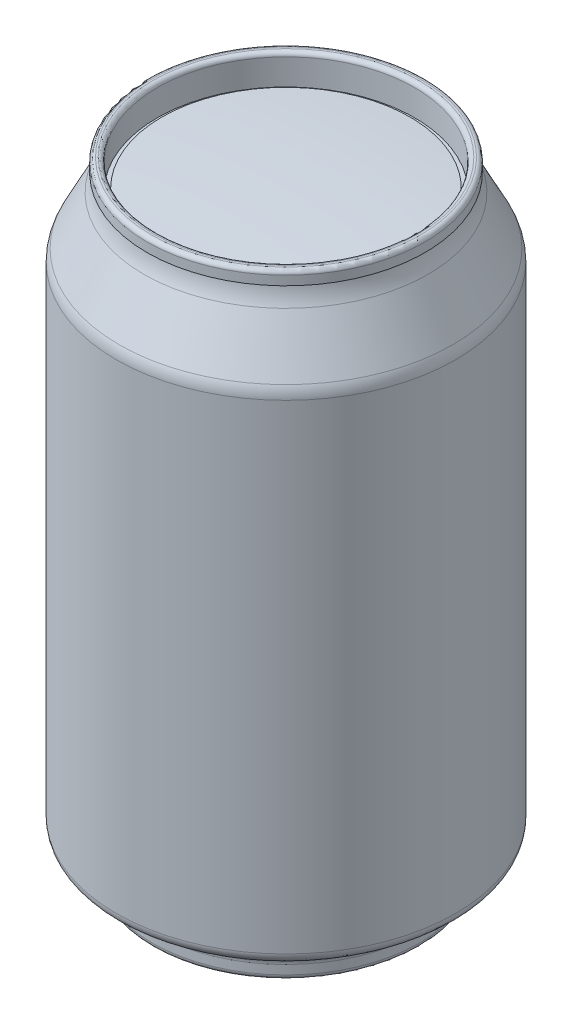
ISO-10303-21;
HEADER;
FILE_DESCRIPTION(('STEP AP214'),'2;1');
FILE_NAME('part.step','',(''),(''),'','','');
FILE_SCHEMA(('AUTOMOTIVE_DESIGN { 1 0 10303 214 1 1 1 1 }'));
ENDSEC;
DATA;
#1=APPLICATION_CONTEXT('core data for automotive mechanical design processes');
#2=APPLICATION_PROTOCOL_DEFINITION('international standard','automotive_design',2000,#1);
#3=PRODUCT_CONTEXT('',#1,'mechanical');
#4=PRODUCT('Part','Part','',(#3));
#5=PRODUCT_RELATED_PRODUCT_CATEGORY('part','',(#4));
#6=PRODUCT_DEFINITION_FORMATION('','',#4);
#7=PRODUCT_DEFINITION_CONTEXT('part definition',#1,'design');
#8=PRODUCT_DEFINITION('design','',#6,#7);
#9=PRODUCT_DEFINITION_SHAPE('','',#8);
#10=(LENGTH_UNIT() NAMED_UNIT(*) SI_UNIT(.MILLI.,.METRE.));
#11=(NAMED_UNIT(*) PLANE_ANGLE_UNIT() SI_UNIT($,.RADIAN.));
#12=(NAMED_UNIT(*) SI_UNIT($,.STERADIAN.) SOLID_ANGLE_UNIT());
#13=UNCERTAINTY_MEASURE_WITH_UNIT(LENGTH_MEASURE(1.E-05),#10,'distance_accuracy_value','');
#14=(GEOMETRIC_REPRESENTATION_CONTEXT(3) GLOBAL_UNCERTAINTY_ASSIGNED_CONTEXT((#13)) GLOBAL_UNIT_ASSIGNED_CONTEXT((#10,
#11,#12)) REPRESENTATION_CONTEXT('',''));
#15=CARTESIAN_POINT('',(0.,0.,0.));
#16=DIRECTION('',(0.,0.,1.));
#17=DIRECTION('',(1.,0.,0.));
#18=AXIS2_PLACEMENT_3D('',#15,#16,#17);
#19=CARTESIAN_POINT('',(0.,60.325,0.));
#20=DIRECTION('',(0.,-1.,0.));
#21=DIRECTION('',(0.,0.,-1.));
#22=AXIS2_PLACEMENT_3D('',#19,#20,#21);
#23=CYLINDRICAL_SURFACE('',#22,33.07);
#24=CARTESIAN_POINT('',(0.,42.6246062045994,0.));
#25=DIRECTION('',(0.,-1.,0.));
#26=DIRECTION('',(0.,0.,-1.));
#27=AXIS2_PLACEMENT_3D('',#24,#25,#26);
#28=CIRCLE('',#27,33.07);
#29=CARTESIAN_POINT('',(0.,42.6246062045994,-33.07));
#30=VERTEX_POINT('',#29);
#31=EDGE_CURVE('E142',#30,#30,#28,.T.);
#32=CARTESIAN_POINT('',(0.,-50.8534471311811,0.));
#33=DIRECTION('',(0.,1.,0.));
#34=DIRECTION('',(0.,0.,1.));
#35=AXIS2_PLACEMENT_3D('',#32,#33,#34);
#36=CIRCLE('',#35,33.07);
#37=CARTESIAN_POINT('',(0.,-50.8534471311811,-33.07));
#38=VERTEX_POINT('',#37);
#39=EDGE_CURVE('E126',#38,#38,#36,.F.);
#40=CARTESIAN_POINT('',(0.,42.6246062045994,-33.07));
#41=CARTESIAN_POINT('',(0.,41.6508764823517,-33.07));
#42=CARTESIAN_POINT('',(0.,40.677146760104,-33.07));
#43=CARTESIAN_POINT('',(0.,38.7296873156086,-33.07));
#44=CARTESIAN_POINT('',(0.,37.7559575933609,-33.07));
#45=CARTESIAN_POINT('',(0.,35.8084981488654,-33.07));
#46=CARTESIAN_POINT('',(0.,34.8347684266177,-33.07));
#47=CARTESIAN_POINT('',(0.,32.8873089821223,-33.07));
#48=CARTESIAN_POINT('',(0.,31.9135792598746,-33.07));
#49=CARTESIAN_POINT('',(0.,29.9661198153791,-33.07));
#50=CARTESIAN_POINT('',(0.,28.9923900931314,-33.07));
#51=CARTESIAN_POINT('',(0.,27.044930648636,-33.07));
#52=CARTESIAN_POINT('',(0.,26.0712009263883,-33.07));
#53=CARTESIAN_POINT('',(0.,24.1237414818929,-33.07));
#54=CARTESIAN_POINT('',(0.,23.1500117596451,-33.07));
#55=CARTESIAN_POINT('',(0.,21.2025523151497,-33.07));
#56=CARTESIAN_POINT('',(0.,20.228822592902,-33.07));
#57=CARTESIAN_POINT('',(0.,18.2813631484066,-33.07));
#58=CARTESIAN_POINT('',(0.,17.3076334261589,-33.07));
#59=CARTESIAN_POINT('',(0.,15.3601739816634,-33.07));
#60=CARTESIAN_POINT('',(0.,14.3864442594157,-33.07));
#61=CARTESIAN_POINT('',(0.,12.4389848149203,-33.07));
#62=CARTESIAN_POINT('',(0.,11.4652550926726,-33.07));
#63=CARTESIAN_POINT('',(0.,9.51779564817715,-33.07));
#64=CARTESIAN_POINT('',(0.,8.54406592592944,-33.07));
#65=CARTESIAN_POINT('',(0.,6.59660648143401,-33.07));
#66=CARTESIAN_POINT('',(0.,5.62287675918629,-33.07));
#67=CARTESIAN_POINT('',(0.,3.67541731469086,-33.07));
#68=CARTESIAN_POINT('',(0.,2.70168759244315,-33.07));
#69=CARTESIAN_POINT('',(0.,0.754228147947724,-33.07));
#70=CARTESIAN_POINT('',(0.,-0.219501574299991,-33.07));
#71=CARTESIAN_POINT('',(0.,-2.16696101879542,-33.07));
#72=CARTESIAN_POINT('',(0.,-3.14069074104313,-33.07));
#73=CARTESIAN_POINT('',(0.,-5.08815018553855,-33.07));
#74=CARTESIAN_POINT('',(0.,-6.06187990778627,-33.07));
#75=CARTESIAN_POINT('',(0.,-8.0093393522817,-33.07));
#76=CARTESIAN_POINT('',(0.,-8.98306907452942,-33.07));
#77=CARTESIAN_POINT('',(0.,-10.9305285190249,-33.07));
#78=CARTESIAN_POINT('',(0.,-11.9042582412726,-33.07));
#79=CARTESIAN_POINT('',(0.,-13.851717685768,-33.07));
#80=CARTESIAN_POINT('',(0.,-14.8254474080157,-33.07));
#81=CARTESIAN_POINT('',(0.,-16.7729068525111,-33.07));
#82=CARTESIAN_POINT('',(0.,-17.7466365747588,-33.07));
#83=CARTESIAN_POINT('',(0.,-19.6940960192543,-33.07));
#84=CARTESIAN_POINT('',(0.,-20.667825741502,-33.07));
#85=CARTESIAN_POINT('',(0.,-22.6152851859974,-33.07));
#86=CARTESIAN_POINT('',(0.,-23.5890149082451,-33.07));
#87=CARTESIAN_POINT('',(0.,-25.5364743527406,-33.07));
#88=CARTESIAN_POINT('',(0.,-26.5102040749883,-33.07));
#89=CARTESIAN_POINT('',(0.,-28.4576635194837,-33.07));
#90=CARTESIAN_POINT('',(0.,-29.4313932417314,-33.07));
#91=CARTESIAN_POINT('',(0.,-31.3788526862268,-33.07));
#92=CARTESIAN_POINT('',(0.,-32.3525824084746,-33.07));
#93=CARTESIAN_POINT('',(0.,-34.30004185297,-33.07));
#94=CARTESIAN_POINT('',(0.,-35.2737715752177,-33.07));
#95=CARTESIAN_POINT('',(0.,-37.2212310197131,-33.07));
#96=CARTESIAN_POINT('',(0.,-38.1949607419608,-33.07));
#97=CARTESIAN_POINT('',(0.,-40.1424201864563,-33.07));
#98=CARTESIAN_POINT('',(0.,-41.116149908704,-33.07));
#99=CARTESIAN_POINT('',(0.,-43.0636093531994,-33.07));
#100=CARTESIAN_POINT('',(0.,-44.0373390754471,-33.07));
#101=CARTESIAN_POINT('',(0.,-45.9847985199426,-33.07));
#102=CARTESIAN_POINT('',(0.,-46.9585282421903,-33.07));
#103=CARTESIAN_POINT('',(0.,-48.9059876866857,-33.07));
#104=CARTESIAN_POINT('',(0.,-49.8797174089334,-33.07));
#105=CARTESIAN_POINT('',(0.,-50.8534471311811,-33.07));
#106=B_SPLINE_CURVE_WITH_KNOTS('',3,(#40,#41,#42,#43,#44,#45,#46,#47,#48,#49,#50,#51,#52,#53,
#54,#55,#56,#57,#58,#59,#60,#61,#62,#63,#64,#65,#66,#67,#68,#69,#70,#71,#72,#73,#74,#75,#76,#77,
#78,#79,#80,#81,#82,#83,#84,#85,#86,#87,#88,#89,#90,#91,#92,#93,#94,#95,#96,#97,#98,#99,#100,
#101,#102,#103,#104,#105),.UNSPECIFIED.,.F.,.F.,(4,2,2,2,2,2,2,2,2,2,2,2,2,2,2,2,2,2,2,2,2,2,2,
2,2,2,2,2,2,2,2,2,4),(0.,2.92118916674314,5.84237833348628,8.76356750022943,11.6847566669726,
14.6059458337157,17.5271350004589,20.448324167202,23.3695133339451,26.2907025006883,
29.2118916674314,32.1330808341746,35.0542700009177,37.9754591676609,40.896648334404,
43.8178375011471,46.7390266678903,49.6602158346334,52.5814050013766,55.5025941681197,
58.4237833348628,61.344972501606,64.2661616683491,67.1873508350923,70.1085400018354,
73.0297291685786,75.9509183353217,78.8721075020648,81.793296668808,84.7144858355511,
87.6356750022943,90.5568641690374,93.4780533357805),.UNSPECIFIED.);
#107=EDGE_CURVE('BSEAM35',#30,#38,#106,.T.);
#108=ORIENTED_EDGE('',*,*,#31,.T.);
#109=ORIENTED_EDGE('',*,*,#39,.F.);
#110=ORIENTED_EDGE('',*,*,#107,.T.);
#111=ORIENTED_EDGE('',*,*,#107,.F.);
#112=EDGE_LOOP('',(#108,#110,#109,#111));
#113=FACE_BOUND('',#112,.T.);
#114=ADVANCED_FACE('F35',(#113),#23,.T.);
#115=CARTESIAN_POINT('',(0.,60.325,0.));
#116=DIRECTION('',(0.,1.,0.));
#117=DIRECTION('',(0.,0.,1.));
#118=AXIS2_PLACEMENT_3D('',#115,#116,#117);
#119=PLANE('',#118);
#120=CARTESIAN_POINT('',(0.,60.325,0.));
#121=DIRECTION('',(0.,1.,0.));
#122=DIRECTION('',(0.,0.,1.));
#123=AXIS2_PLACEMENT_3D('',#120,#121,#122);
#124=CIRCLE('',#123,25.8939233649424);
#125=CARTESIAN_POINT('',(0.,60.325,25.8939233649424));
#126=VERTEX_POINT('',#125);
#127=EDGE_CURVE('E133',#126,#126,#124,.F.);
#128=ORIENTED_EDGE('',*,*,#127,.T.);
#129=EDGE_LOOP('',(#128));
#130=FACE_BOUND('',#129,.T.);
#131=CARTESIAN_POINT('',(0.,60.325,0.));
#132=DIRECTION('',(0.,1.,0.));
#133=DIRECTION('',(0.,0.,1.));
#134=AXIS2_PLACEMENT_3D('',#131,#132,#133);
#135=CIRCLE('',#134,26.2660766350576);
#136=CARTESIAN_POINT('',(0.,60.325,26.2660766350576));
#137=VERTEX_POINT('',#136);
#138=EDGE_CURVE('E136',#137,#137,#135,.T.);
#139=ORIENTED_EDGE('',*,*,#138,.T.);
#140=EDGE_LOOP('',(#139));
#141=FACE_BOUND('',#140,.T.);
#142=ADVANCED_FACE('F198',(#130,#141),#119,.T.);
#143=CARTESIAN_POINT('',(0.,66.3575,0.));
#144=DIRECTION('',(0.,1.,0.));
#145=DIRECTION('',(0.,0.,1.));
#146=AXIS2_PLACEMENT_3D('',#143,#144,#145);
#147=CYLINDRICAL_SURFACE('',#146,27.08);
#148=CARTESIAN_POINT('',(0.,59.5110766350576,0.));
#149=DIRECTION('',(0.,1.,0.));
#150=DIRECTION('',(0.,0.,1.));
#151=AXIS2_PLACEMENT_3D('',#148,#149,#150);
#152=CIRCLE('',#151,27.08);
#153=CARTESIAN_POINT('',(0.,59.5110766350576,27.08));
#154=VERTEX_POINT('',#153);
#155=EDGE_CURVE('E125',#154,#154,#152,.F.);
#156=ORIENTED_EDGE('',*,*,#155,.T.);
#157=EDGE_LOOP('',(#156));
#158=FACE_BOUND('',#157,.T.);
#159=CARTESIAN_POINT('',(0.,57.725,0.));
#160=DIRECTION('',(0.,1.,0.));
#161=DIRECTION('',(0.,0.,1.));
#162=AXIS2_PLACEMENT_3D('',#159,#160,#161);
#163=CIRCLE('',#162,27.08);
#164=CARTESIAN_POINT('',(0.,57.725,27.08));
#165=VERTEX_POINT('',#164);
#166=EDGE_CURVE('E148',#165,#165,#163,.T.);
#167=ORIENTED_EDGE('',*,*,#166,.T.);
#168=EDGE_LOOP('',(#167));
#169=FACE_BOUND('',#168,.T.);
#170=ADVANCED_FACE('F204',(#158,#169),#147,.T.);
#171=CARTESIAN_POINT('',(0.,57.725,0.));
#172=DIRECTION('',(0.,1.,0.));
#173=DIRECTION('',(0.,0.,1.));
#174=AXIS2_PLACEMENT_3D('',#171,#172,#173);
#175=CONICAL_SURFACE('',#174,27.08,1.3962634015955);
#176=CARTESIAN_POINT('',(0.,57.6624866560399,0.));
#177=DIRECTION('',(0.,1.,0.));
#178=DIRECTION('',(0.,0.,1.));
#179=AXIS2_PLACEMENT_3D('',#176,#177,#178);
#180=CIRCLE('',#179,26.7254692089156);
#181=CARTESIAN_POINT('',(0.,57.6624866560399,26.7254692089156));
#182=VERTEX_POINT('',#181);
#183=EDGE_CURVE('E151',#182,#182,#180,.T.);
#184=ORIENTED_EDGE('',*,*,#183,.T.);
#185=EDGE_LOOP('',(#184));
#186=FACE_BOUND('',#185,.T.);
#187=ORIENTED_EDGE('',*,*,#166,.F.);
#188=EDGE_LOOP('',(#187));
#189=FACE_BOUND('',#188,.T.);
#190=ADVANCED_FACE('F567',(#186,#189),#175,.T.);
#191=CARTESIAN_POINT('',(0.,58.6382978393263,0.));
#192=DIRECTION('',(0.,1.,0.));
#193=DIRECTION('',(0.,0.,1.));
#194=AXIS2_PLACEMENT_3D('',#191,#192,#193);
#195=TOROIDAL_SURFACE('',#194,36.0967703986861,9.42196866131597);
#196=CARTESIAN_POINT('',(0.,54.3608135782452,0.));
#197=DIRECTION('',(0.,1.,0.));
#198=DIRECTION('',(0.,0.,1.));
#199=AXIS2_PLACEMENT_3D('',#196,#197,#198);
#200=CIRCLE('',#199,27.7017348507552);
#201=CARTESIAN_POINT('',(0.,54.3608135782452,27.7017348507552));
#202=VERTEX_POINT('',#201);
#203=EDGE_CURVE('E154',#202,#202,#200,.T.);
#204=ORIENTED_EDGE('',*,*,#203,.T.);
#205=EDGE_LOOP('',(#204));
#206=FACE_BOUND('',#205,.T.);
#207=ORIENTED_EDGE('',*,*,#183,.F.);
#208=EDGE_LOOP('',(#207));
#209=FACE_BOUND('',#208,.T.);
#210=ADVANCED_FACE('F594',(#206,#209),#195,.F.);
#211=CARTESIAN_POINT('',(0.,54.3608135782452,0.));
#212=DIRECTION('',(0.,-1.,0.));
#213=DIRECTION('',(0.,0.,-1.));
#214=AXIS2_PLACEMENT_3D('',#211,#212,#213);
#215=CONICAL_SURFACE('',#214,27.7017348507552,0.471238898038463);
#216=CARTESIAN_POINT('',(0.,44.8945587032971,0.));
#217=DIRECTION('',(0.,-1.,0.));
#218=DIRECTION('',(0.,0.,-1.));
#219=AXIS2_PLACEMENT_3D('',#216,#217,#218);
#220=CIRCLE('',#219,32.5250326209419);
#221=CARTESIAN_POINT('',(0.,44.8945587032971,-32.5250326209419));
#222=VERTEX_POINT('',#221);
#223=EDGE_CURVE('E145',#222,#222,#220,.F.);
#224=ORIENTED_EDGE('',*,*,#223,.T.);
#225=EDGE_LOOP('',(#224));
#226=FACE_BOUND('',#225,.T.);
#227=ORIENTED_EDGE('',*,*,#203,.F.);
#228=EDGE_LOOP('',(#227));
#229=FACE_BOUND('',#228,.T.);
#230=ADVANCED_FACE('F589',(#226,#229),#215,.T.);
#231=CARTESIAN_POINT('',(0.,-233.734684697434,0.));
#232=DIRECTION('',(0.,1.,0.));
#233=DIRECTION('',(-1.,0.,0.));
#234=AXIS2_PLACEMENT_3D('',#231,#232,#233);
#235=SPHERICAL_SURFACE('',#234,289.749684697434);
#236=CARTESIAN_POINT('',(0.,55.0043105599826,0.));
#237=DIRECTION('',(0.,1.,0.));
#238=DIRECTION('',(0.,0.,1.));
#239=AXIS2_PLACEMENT_3D('',#236,#237,#238);
#240=CIRCLE('',#239,24.18);
#241=CARTESIAN_POINT('',(0.,55.0043105599826,24.18));
#242=VERTEX_POINT('',#241);
#243=EDGE_CURVE('E163',#242,#242,#240,.T.);
#244=ORIENTED_EDGE('',*,*,#243,.T.);
#245=EDGE_LOOP('',(#244));
#246=FACE_BOUND('',#245,.T.);
#247=ADVANCED_FACE('F553',(#246),#235,.T.);
#248=CARTESIAN_POINT('',(0.,66.3575,0.));
#249=DIRECTION('',(0.,1.,0.));
#250=DIRECTION('',(0.,0.,1.));
#251=AXIS2_PLACEMENT_3D('',#248,#249,#250);
#252=CYLINDRICAL_SURFACE('',#251,25.08);
#253=CARTESIAN_POINT('',(0.,59.5110766350576,0.));
#254=DIRECTION('',(0.,1.,0.));
#255=DIRECTION('',(0.,0.,1.));
#256=AXIS2_PLACEMENT_3D('',#253,#254,#255);
#257=CIRCLE('',#256,25.08);
#258=CARTESIAN_POINT('',(0.,59.5110766350576,25.08));
#259=VERTEX_POINT('',#258);
#260=EDGE_CURVE('E139',#259,#259,#257,.T.);
#261=ORIENTED_EDGE('',*,*,#260,.T.);
#262=EDGE_LOOP('',(#261));
#263=FACE_BOUND('',#262,.T.);
#264=CARTESIAN_POINT('',(0.,54.425,0.));
#265=DIRECTION('',(0.,1.,0.));
#266=DIRECTION('',(0.,0.,1.));
#267=AXIS2_PLACEMENT_3D('',#264,#265,#266);
#268=CIRCLE('',#267,25.08);
#269=CARTESIAN_POINT('',(0.,54.425,25.08));
#270=VERTEX_POINT('',#269);
#271=EDGE_CURVE('E157',#270,#270,#268,.T.);
#272=ORIENTED_EDGE('',*,*,#271,.F.);
#273=EDGE_LOOP('',(#272));
#274=FACE_BOUND('',#273,.T.);
#275=ADVANCED_FACE('F547',(#263,#274),#252,.F.);
#276=CARTESIAN_POINT('',(25.08,54.425,0.));
#277=DIRECTION('',(0.,1.,0.));
#278=DIRECTION('',(0.,0.,1.));
#279=AXIS2_PLACEMENT_3D('',#276,#277,#278);
#280=PLANE('',#279);
#281=ORIENTED_EDGE('',*,*,#271,.T.);
#282=EDGE_LOOP('',(#281));
#283=FACE_BOUND('',#282,.T.);
#284=CARTESIAN_POINT('',(0.,54.425,0.));
#285=DIRECTION('',(0.,1.,0.));
#286=DIRECTION('',(0.,0.,1.));
#287=AXIS2_PLACEMENT_3D('',#284,#285,#286);
#288=CIRCLE('',#287,24.18);
#289=CARTESIAN_POINT('',(0.,54.425,24.18));
#290=VERTEX_POINT('',#289);
#291=EDGE_CURVE('E160',#290,#290,#288,.T.);
#292=ORIENTED_EDGE('',*,*,#291,.F.);
#293=EDGE_LOOP('',(#292));
#294=FACE_BOUND('',#293,.T.);
#295=ADVANCED_FACE('F552',(#283,#294),#280,.T.);
#296=CARTESIAN_POINT('',(0.,66.3575,0.));
#297=DIRECTION('',(0.,1.,0.));
#298=DIRECTION('',(0.,0.,1.));
#299=AXIS2_PLACEMENT_3D('',#296,#297,#298);
#300=CYLINDRICAL_SURFACE('',#299,24.18);
#301=ORIENTED_EDGE('',*,*,#291,.T.);
#302=EDGE_LOOP('',(#301));
#303=FACE_BOUND('',#302,.T.);
#304=ORIENTED_EDGE('',*,*,#243,.F.);
#305=EDGE_LOOP('',(#304));
#306=FACE_BOUND('',#305,.T.);
#307=ADVANCED_FACE('F215',(#303,#306),#300,.T.);
#308=CARTESIAN_POINT('',(0.,42.6246062045994,0.));
#309=DIRECTION('',(0.,-1.,0.));
#310=DIRECTION('',(0.,0.,-1.));
#311=AXIS2_PLACEMENT_3D('',#308,#309,#310);
#312=TOROIDAL_SURFACE('',#311,28.07,5.);
#313=ORIENTED_EDGE('',*,*,#31,.F.);
#314=EDGE_LOOP('',(#313));
#315=FACE_BOUND('',#314,.T.);
#316=ORIENTED_EDGE('',*,*,#223,.F.);
#317=EDGE_LOOP('',(#316));
#318=FACE_BOUND('',#317,.T.);
#319=ADVANCED_FACE('F211',(#315,#318),#312,.T.);
#320=CARTESIAN_POINT('',(0.,59.5110766350576,0.));
#321=DIRECTION('',(0.,1.,0.));
#322=DIRECTION('',(0.,0.,1.));
#323=AXIS2_PLACEMENT_3D('',#320,#321,#322);
#324=TOROIDAL_SURFACE('',#323,25.8939233649424,0.81392336494242);
#325=ORIENTED_EDGE('',*,*,#127,.F.);
#326=EDGE_LOOP('',(#325));
#327=FACE_BOUND('',#326,.T.);
#328=ORIENTED_EDGE('',*,*,#260,.F.);
#329=EDGE_LOOP('',(#328));
#330=FACE_BOUND('',#329,.T.);
#331=ADVANCED_FACE('F214',(#327,#330),#324,.T.);
#332=CARTESIAN_POINT('',(0.,59.5110766350576,0.));
#333=DIRECTION('',(0.,1.,0.));
#334=DIRECTION('',(0.,0.,1.));
#335=AXIS2_PLACEMENT_3D('',#332,#333,#334);
#336=TOROIDAL_SURFACE('',#335,26.2660766350576,0.81392336494242);
#337=ORIENTED_EDGE('',*,*,#155,.F.);
#338=EDGE_LOOP('',(#337));
#339=FACE_BOUND('',#338,.T.);
#340=ORIENTED_EDGE('',*,*,#138,.F.);
#341=EDGE_LOOP('',(#340));
#342=FACE_BOUND('',#341,.T.);
#343=ADVANCED_FACE('F219',(#339,#342),#336,.T.);
#344=CARTESIAN_POINT('',(0.,-50.8392235655911,0.));
#345=DIRECTION('',(0.,1.,0.));
#346=DIRECTION('',(0.,0.,1.));
#347=AXIS2_PLACEMENT_3D('',#344,#345,#346);
#348=TOROIDAL_SURFACE('',#347,30.7716764049348,2.29836760711853);
#349=CARTESIAN_POINT('',(0.,-52.8114723207275,0.));
#350=DIRECTION('',(0.,1.,0.));
#351=DIRECTION('',(0.,0.,1.));
#352=AXIS2_PLACEMENT_3D('',#349,#350,#351);
#353=CIRCLE('',#352,31.9518155938928);
#354=CARTESIAN_POINT('',(0.,-52.8114723207275,31.9518155938928));
#355=VERTEX_POINT('',#354);
#356=EDGE_CURVE('E173',#355,#355,#353,.T.);
#357=ORIENTED_EDGE('',*,*,#356,.T.);
#358=EDGE_LOOP('',(#357));
#359=FACE_BOUND('',#358,.T.);
#360=ORIENTED_EDGE('',*,*,#39,.T.);
#361=EDGE_LOOP('',(#360));
#362=FACE_BOUND('',#361,.T.);
#363=ADVANCED_FACE('F177',(#359,#362),#348,.T.);
#364=CARTESIAN_POINT('',(0.,66.3575,0.));
#365=DIRECTION('',(0.,1.,0.));
#366=DIRECTION('',(0.,0.,1.));
#367=AXIS2_PLACEMENT_3D('',#364,#365,#366);
#368=CYLINDRICAL_SURFACE('',#367,26.085);
#369=CARTESIAN_POINT('',(0.,-59.325,0.));
#370=DIRECTION('',(0.,1.,0.));
#371=DIRECTION('',(0.,0.,1.));
#372=AXIS2_PLACEMENT_3D('',#369,#370,#371);
#373=CIRCLE('',#372,26.085);
#374=CARTESIAN_POINT('',(0.,-59.325,26.085));
#375=VERTEX_POINT('',#374);
#376=EDGE_CURVE('E120',#375,#375,#373,.T.);
#377=ORIENTED_EDGE('',*,*,#376,.T.);
#378=EDGE_LOOP('',(#377));
#379=FACE_BOUND('',#378,.T.);
#380=CARTESIAN_POINT('',(0.,-57.575,0.));
#381=DIRECTION('',(0.,1.,0.));
#382=DIRECTION('',(0.,0.,1.));
#383=AXIS2_PLACEMENT_3D('',#380,#381,#382);
#384=CIRCLE('',#383,26.085);
#385=CARTESIAN_POINT('',(0.,-57.575,26.085));
#386=VERTEX_POINT('',#385);
#387=EDGE_CURVE('E130',#386,#386,#384,.T.);
#388=ORIENTED_EDGE('',*,*,#387,.F.);
#389=EDGE_LOOP('',(#388));
#390=FACE_BOUND('',#389,.T.);
#391=ADVANCED_FACE('F193',(#379,#390),#368,.T.);
#392=CARTESIAN_POINT('',(0.,-57.575,0.));
#393=DIRECTION('',(0.,1.,0.));
#394=DIRECTION('',(0.,0.,1.));
#395=AXIS2_PLACEMENT_3D('',#392,#393,#394);
#396=TOROIDAL_SURFACE('',#395,28.2949264324055,2.20992643240551);
#397=ORIENTED_EDGE('',*,*,#387,.T.);
#398=EDGE_LOOP('',(#397));
#399=FACE_BOUND('',#398,.T.);
#400=CARTESIAN_POINT('',(0.,-55.678643367686,0.));
#401=DIRECTION('',(0.,1.,0.));
#402=DIRECTION('',(0.,0.,1.));
#403=AXIS2_PLACEMENT_3D('',#400,#401,#402);
#404=CIRCLE('',#403,27.1601989938885);
#405=CARTESIAN_POINT('',(0.,-55.678643367686,27.1601989938885));
#406=VERTEX_POINT('',#405);
#407=EDGE_CURVE('E170',#406,#406,#404,.T.);
#408=ORIENTED_EDGE('',*,*,#407,.F.);
#409=EDGE_LOOP('',(#408));
#410=FACE_BOUND('',#409,.T.);
#411=ADVANCED_FACE('F183',(#399,#410),#396,.F.);
#412=CARTESIAN_POINT('',(0.,-52.8114723207275,0.));
#413=DIRECTION('',(0.,1.,0.));
#414=DIRECTION('',(0.,0.,1.));
#415=AXIS2_PLACEMENT_3D('',#412,#413,#414);
#416=CONICAL_SURFACE('',#415,31.9518155938928,1.03157446258859);
#417=ORIENTED_EDGE('',*,*,#407,.T.);
#418=EDGE_LOOP('',(#417));
#419=FACE_BOUND('',#418,.T.);
#420=ORIENTED_EDGE('',*,*,#356,.F.);
#421=EDGE_LOOP('',(#420));
#422=FACE_BOUND('',#421,.T.);
#423=ADVANCED_FACE('F180',(#419,#422),#416,.T.);
#424=CARTESIAN_POINT('',(0.,-86.1527825443787,0.));
#425=DIRECTION('',(0.,1.,0.));
#426=DIRECTION('',(1.,0.,0.));
#427=AXIS2_PLACEMENT_3D('',#424,#425,#426);
#428=SPHERICAL_SURFACE('',#427,37.0277825443787);
#429=CARTESIAN_POINT('',(0.,-57.575,0.));
#430=DIRECTION('',(0.,1.,0.));
#431=DIRECTION('',(0.,0.,1.));
#432=AXIS2_PLACEMENT_3D('',#429,#430,#431);
#433=CIRCLE('',#432,23.545);
#434=CARTESIAN_POINT('',(0.,-57.575,23.545));
#435=VERTEX_POINT('',#434);
#436=EDGE_CURVE('E129',#435,#435,#433,.T.);
#437=ORIENTED_EDGE('',*,*,#436,.F.);
#438=EDGE_LOOP('',(#437));
#439=FACE_BOUND('',#438,.T.);
#440=ADVANCED_FACE('F182',(#439),#428,.F.);
#441=CARTESIAN_POINT('',(0.,66.3575,0.));
#442=DIRECTION('',(0.,1.,0.));
#443=DIRECTION('',(0.,0.,1.));
#444=AXIS2_PLACEMENT_3D('',#441,#442,#443);
#445=CYLINDRICAL_SURFACE('',#444,23.545);
#446=CARTESIAN_POINT('',(0.,-59.325,0.));
#447=DIRECTION('',(0.,1.,0.));
#448=DIRECTION('',(0.,0.,1.));
#449=AXIS2_PLACEMENT_3D('',#446,#447,#448);
#450=CIRCLE('',#449,23.545);
#451=CARTESIAN_POINT('',(0.,-59.325,23.545));
#452=VERTEX_POINT('',#451);
#453=EDGE_CURVE('E52',#452,#452,#450,.F.);
#454=ORIENTED_EDGE('',*,*,#453,.T.);
#455=EDGE_LOOP('',(#454));
#456=FACE_BOUND('',#455,.T.);
#457=ORIENTED_EDGE('',*,*,#436,.T.);
#458=EDGE_LOOP('',(#457));
#459=FACE_BOUND('',#458,.T.);
#460=ADVANCED_FACE('F190',(#456,#459),#445,.F.);
#461=CARTESIAN_POINT('',(0.,-60.325,0.));
#462=DIRECTION('',(0.,1.,0.));
#463=DIRECTION('',(0.,0.,1.));
#464=AXIS2_PLACEMENT_3D('',#461,#462,#463);
#465=PLANE('',#464);
#466=CARTESIAN_POINT('',(0.,-60.325,0.));
#467=DIRECTION('',(0.,1.,0.));
#468=DIRECTION('',(0.,0.,1.));
#469=AXIS2_PLACEMENT_3D('',#466,#467,#468);
#470=CIRCLE('',#469,25.085);
#471=CARTESIAN_POINT('',(0.,-60.325,25.085));
#472=VERTEX_POINT('',#471);
#473=EDGE_CURVE('E112',#472,#472,#470,.F.);
#474=ORIENTED_EDGE('',*,*,#473,.T.);
#475=EDGE_LOOP('',(#474));
#476=FACE_BOUND('',#475,.T.);
#477=CARTESIAN_POINT('',(0.,-60.325,0.));
#478=DIRECTION('',(0.,1.,0.));
#479=DIRECTION('',(0.,0.,1.));
#480=AXIS2_PLACEMENT_3D('',#477,#478,#479);
#481=CIRCLE('',#480,24.545);
#482=CARTESIAN_POINT('',(0.,-60.325,24.545));
#483=VERTEX_POINT('',#482);
#484=EDGE_CURVE('E116',#483,#483,#481,.T.);
#485=ORIENTED_EDGE('',*,*,#484,.T.);
#486=EDGE_LOOP('',(#485));
#487=FACE_BOUND('',#486,.T.);
#488=ADVANCED_FACE('F210',(#476,#487),#465,.F.);
#489=CARTESIAN_POINT('',(0.,-59.325,0.));
#490=DIRECTION('',(0.,1.,0.));
#491=DIRECTION('',(0.,0.,1.));
#492=AXIS2_PLACEMENT_3D('',#489,#490,#491);
#493=TOROIDAL_SURFACE('',#492,25.085,1.);
#494=ORIENTED_EDGE('',*,*,#473,.F.);
#495=EDGE_LOOP('',(#494));
#496=FACE_BOUND('',#495,.T.);
#497=ORIENTED_EDGE('',*,*,#376,.F.);
#498=EDGE_LOOP('',(#497));
#499=FACE_BOUND('',#498,.T.);
#500=ADVANCED_FACE('F224',(#496,#499),#493,.T.);
#501=CARTESIAN_POINT('',(0.,-59.325,0.));
#502=DIRECTION('',(0.,1.,0.));
#503=DIRECTION('',(0.,0.,1.));
#504=AXIS2_PLACEMENT_3D('',#501,#502,#503);
#505=TOROIDAL_SURFACE('',#504,24.545,1.);
#506=ORIENTED_EDGE('',*,*,#453,.F.);
#507=EDGE_LOOP('',(#506));
#508=FACE_BOUND('',#507,.T.);
#509=ORIENTED_EDGE('',*,*,#484,.F.);
#510=EDGE_LOOP('',(#509));
#511=FACE_BOUND('',#510,.T.);
#512=ADVANCED_FACE('F227',(#508,#511),#505,.T.);
#513=CLOSED_SHELL('',(#114,#142,#170,#190,#210,#230,#247,#275,#295,#307,#319,#331,#343,#363,
#391,#411,#423,#440,#460,#488,#500,#512));
#514=CARTESIAN_POINT('',(0.,60.325,0.));
#515=DIRECTION('',(0.,-1.,0.));
#516=DIRECTION('',(0.,0.,-1.));
#517=AXIS2_PLACEMENT_3D('',#514,#515,#516);
#518=CYLINDRICAL_SURFACE('',#517,32.84);
#519=CARTESIAN_POINT('',(0.,42.6246062045994,0.));
#520=DIRECTION('',(0.,-1.,0.));
#521=DIRECTION('',(0.,0.,-1.));
#522=AXIS2_PLACEMENT_3D('',#519,#520,#521);
#523=CIRCLE('',#522,32.84);
#524=CARTESIAN_POINT('',(0.,42.6246062045994,-32.84));
#525=VERTEX_POINT('',#524);
#526=EDGE_CURVE('E39',#525,#525,#523,.T.);
#527=CARTESIAN_POINT('',(0.,-50.8527166850817,0.));
#528=DIRECTION('',(0.,1.,0.));
#529=DIRECTION('',(0.,0.,1.));
#530=AXIS2_PLACEMENT_3D('',#527,#528,#529);
#531=CIRCLE('',#530,32.84);
#532=CARTESIAN_POINT('',(0.,-50.8527166850817,-32.84));
#533=VERTEX_POINT('',#532);
#534=EDGE_CURVE('E69',#533,#533,#531,.F.);
#535=CARTESIAN_POINT('',(0.,42.6246062045994,-32.84));
#536=CARTESIAN_POINT('',(0.,41.6508840911653,-32.84));
#537=CARTESIAN_POINT('',(0.,40.6771619777311,-32.84));
#538=CARTESIAN_POINT('',(0.,38.7297177508627,-32.84));
#539=CARTESIAN_POINT('',(0.,37.7559956374285,-32.84));
#540=CARTESIAN_POINT('',(0.,35.8085514105602,-32.84));
#541=CARTESIAN_POINT('',(0.,34.834829297126,-32.84));
#542=CARTESIAN_POINT('',(0.,32.8873850702577,-32.84));
#543=CARTESIAN_POINT('',(0.,31.9136629568235,-32.84));
#544=CARTESIAN_POINT('',(0.,29.9662187299551,-32.84));
#545=CARTESIAN_POINT('',(0.,28.9924966165209,-32.84));
#546=CARTESIAN_POINT('',(0.,27.0450523896526,-32.84));
#547=CARTESIAN_POINT('',(0.,26.0713302762184,-32.84));
#548=CARTESIAN_POINT('',(0.,24.12388604935,-32.84));
#549=CARTESIAN_POINT('',(0.,23.1501639359159,-32.84));
#550=CARTESIAN_POINT('',(0.,21.2027197090475,-32.84));
#551=CARTESIAN_POINT('',(0.,20.2289975956133,-32.84));
#552=CARTESIAN_POINT('',(0.,18.281553368745,-32.84));
#553=CARTESIAN_POINT('',(0.,17.3078312553108,-32.84));
#554=CARTESIAN_POINT('',(0.,15.3603870284424,-32.84));
#555=CARTESIAN_POINT('',(0.,14.3866649150082,-32.84));
#556=CARTESIAN_POINT('',(0.,12.4392206881399,-32.84));
#557=CARTESIAN_POINT('',(0.,11.4654985747057,-32.84));
#558=CARTESIAN_POINT('',(0.,9.51805434783736,-32.84));
#559=CARTESIAN_POINT('',(0.,8.54433223440317,-32.84));
#560=CARTESIAN_POINT('',(0.,6.59688800753482,-32.84));
#561=CARTESIAN_POINT('',(0.,5.62316589410064,-32.84));
#562=CARTESIAN_POINT('',(0.,3.67572166723228,-32.84));
#563=CARTESIAN_POINT('',(0.,2.7019995537981,-32.84));
#564=CARTESIAN_POINT('',(0.,0.754555326929747,-32.84));
#565=CARTESIAN_POINT('',(0.,-0.219166786504433,-32.84));
#566=CARTESIAN_POINT('',(0.,-2.16661101337279,-32.84));
#567=CARTESIAN_POINT('',(0.,-3.14033312680697,-32.84));
#568=CARTESIAN_POINT('',(0.,-5.08777735367532,-32.84));
#569=CARTESIAN_POINT('',(0.,-6.0614994671095,-32.84));
#570=CARTESIAN_POINT('',(0.,-8.00894369397786,-32.84));
#571=CARTESIAN_POINT('',(0.,-8.98266580741204,-32.84));
#572=CARTESIAN_POINT('',(0.,-10.9301100342804,-32.84));
#573=CARTESIAN_POINT('',(0.,-11.9038321477146,-32.84));
#574=CARTESIAN_POINT('',(0.,-13.8512763745829,-32.84));
#575=CARTESIAN_POINT('',(0.,-14.8249984880171,-32.84));
#576=CARTESIAN_POINT('',(0.,-16.7724427148855,-32.84));
#577=CARTESIAN_POINT('',(0.,-17.7461648283197,-32.84));
#578=CARTESIAN_POINT('',(0.,-19.693609055188,-32.84));
#579=CARTESIAN_POINT('',(0.,-20.6673311686222,-32.84));
#580=CARTESIAN_POINT('',(0.,-22.6147753954905,-32.84));
#581=CARTESIAN_POINT('',(0.,-23.5884975089247,-32.84));
#582=CARTESIAN_POINT('',(0.,-25.5359417357931,-32.84));
#583=CARTESIAN_POINT('',(0.,-26.5096638492273,-32.84));
#584=CARTESIAN_POINT('',(0.,-28.4571080760956,-32.84));
#585=CARTESIAN_POINT('',(0.,-29.4308301895298,-32.84));
#586=CARTESIAN_POINT('',(0.,-31.3782744163982,-32.84));
#587=CARTESIAN_POINT('',(0.,-32.3519965298323,-32.84));
#588=CARTESIAN_POINT('',(0.,-34.2994407567007,-32.84));
#589=CARTESIAN_POINT('',(0.,-35.2731628701349,-32.84));
#590=CARTESIAN_POINT('',(0.,-37.2206070970032,-32.84));
#591=CARTESIAN_POINT('',(0.,-38.1943292104374,-32.84));
#592=CARTESIAN_POINT('',(0.,-40.1417734373058,-32.84));
#593=CARTESIAN_POINT('',(0.,-41.1154955507399,-32.84));
#594=CARTESIAN_POINT('',(0.,-43.0629397776083,-32.84));
#595=CARTESIAN_POINT('',(0.,-44.0366618910425,-32.84));
#596=CARTESIAN_POINT('',(0.,-45.9841061179108,-32.84));
#597=CARTESIAN_POINT('',(0.,-46.957828231345,-32.84));
#598=CARTESIAN_POINT('',(0.,-48.9052724582134,-32.84));
#599=CARTESIAN_POINT('',(0.,-49.8789945716476,-32.84));
#600=CARTESIAN_POINT('',(0.,-50.8527166850817,-32.84));
#601=B_SPLINE_CURVE_WITH_KNOTS('',3,(#535,#536,#537,#538,#539,#540,#541,#542,#543,#544,#545,
#546,#547,#548,#549,#550,#551,#552,#553,#554,#555,#556,#557,#558,#559,#560,#561,#562,#563,#564,
#565,#566,#567,#568,#569,#570,#571,#572,#573,#574,#575,#576,#577,#578,#579,#580,#581,#582,#583,
#584,#585,#586,#587,#588,#589,#590,#591,#592,#593,#594,#595,#596,#597,#598,#599,#600),
.UNSPECIFIED.,.F.,.F.,(4,2,2,2,2,2,2,2,2,2,2,2,2,2,2,2,2,2,2,2,2,2,2,2,2,2,2,2,2,2,2,2,4),(0.,
2.92116634030254,5.84233268060508,8.76349902090762,11.6846653612102,14.6058317015127,
17.5269980418152,20.4481643821178,23.3693307224203,26.2904970627228,29.2116634030254,
32.1328297433279,35.0539960836304,37.975162423933,40.8963287642355,43.8174951045381,
46.7386614448406,49.6598277851431,52.5809941254457,55.5021604657482,58.4233268060507,
61.3444931463533,64.2656594866558,67.1868258269583,70.1079921672609,73.0291585075634,
75.950324847866,78.8714911881685,81.792657528471,84.7138238687736,87.6349902090761,
90.5561565493786,93.4773228896812),.UNSPECIFIED.);
#602=EDGE_CURVE('BSEAM232',#525,#533,#601,.T.);
#603=ORIENTED_EDGE('',*,*,#526,.F.);
#604=ORIENTED_EDGE('',*,*,#534,.T.);
#605=ORIENTED_EDGE('',*,*,#602,.T.);
#606=ORIENTED_EDGE('',*,*,#602,.F.);
#607=EDGE_LOOP('',(#603,#605,#604,#606));
#608=FACE_BOUND('',#607,.T.);
#609=ADVANCED_FACE('F232',(#608),#518,.F.);
#610=CARTESIAN_POINT('',(0.,60.095,0.));
#611=DIRECTION('',(0.,1.,0.));
#612=DIRECTION('',(0.,0.,1.));
#613=AXIS2_PLACEMENT_3D('',#610,#611,#612);
#614=PLANE('',#613);
#615=CARTESIAN_POINT('',(0.,60.095,0.));
#616=DIRECTION('',(0.,1.,0.));
#617=DIRECTION('',(0.,0.,1.));
#618=AXIS2_PLACEMENT_3D('',#615,#616,#617);
#619=CIRCLE('',#618,25.8939233649424);
#620=CARTESIAN_POINT('',(0.,60.095,25.8939233649424));
#621=VERTEX_POINT('',#620);
#622=EDGE_CURVE('E104',#621,#621,#619,.F.);
#623=ORIENTED_EDGE('',*,*,#622,.F.);
#624=EDGE_LOOP('',(#623));
#625=FACE_BOUND('',#624,.T.);
#626=CARTESIAN_POINT('',(0.,60.095,0.));
#627=DIRECTION('',(0.,1.,0.));
#628=DIRECTION('',(0.,0.,1.));
#629=AXIS2_PLACEMENT_3D('',#626,#627,#628);
#630=CIRCLE('',#629,26.2660766350576);
#631=CARTESIAN_POINT('',(0.,60.095,26.2660766350576));
#632=VERTEX_POINT('',#631);
#633=EDGE_CURVE('E102',#632,#632,#630,.T.);
#634=ORIENTED_EDGE('',*,*,#633,.F.);
#635=EDGE_LOOP('',(#634));
#636=FACE_BOUND('',#635,.T.);
#637=ADVANCED_FACE('F235',(#625,#636),#614,.F.);
#638=CARTESIAN_POINT('',(0.,66.3575,0.));
#639=DIRECTION('',(0.,1.,0.));
#640=DIRECTION('',(0.,0.,1.));
#641=AXIS2_PLACEMENT_3D('',#638,#639,#640);
#642=CYLINDRICAL_SURFACE('',#641,26.85);
#643=CARTESIAN_POINT('',(0.,59.5110766350576,0.));
#644=DIRECTION('',(0.,1.,0.));
#645=DIRECTION('',(0.,0.,1.));
#646=AXIS2_PLACEMENT_3D('',#643,#644,#645);
#647=CIRCLE('',#646,26.85);
#648=CARTESIAN_POINT('',(0.,59.5110766350576,26.85));
#649=VERTEX_POINT('',#648);
#650=EDGE_CURVE('E99',#649,#649,#647,.F.);
#651=ORIENTED_EDGE('',*,*,#650,.F.);
#652=EDGE_LOOP('',(#651));
#653=FACE_BOUND('',#652,.T.);
#654=CARTESIAN_POINT('',(0.,57.9179929151708,0.));
#655=DIRECTION('',(0.,1.,0.));
#656=DIRECTION('',(0.,0.,1.));
#657=AXIS2_PLACEMENT_3D('',#654,#655,#656);
#658=CIRCLE('',#657,26.85);
#659=CARTESIAN_POINT('',(0.,57.9179929151708,26.85));
#660=VERTEX_POINT('',#659);
#661=EDGE_CURVE('E96',#660,#660,#658,.T.);
#662=ORIENTED_EDGE('',*,*,#661,.F.);
#663=EDGE_LOOP('',(#662));
#664=FACE_BOUND('',#663,.T.);
#665=ADVANCED_FACE('F240',(#653,#664),#642,.F.);
#666=CARTESIAN_POINT('',(0.,57.9515057831928,0.));
#667=DIRECTION('',(0.,1.,0.));
#668=DIRECTION('',(0.,0.,1.));
#669=AXIS2_PLACEMENT_3D('',#666,#667,#668);
#670=CONICAL_SURFACE('',#669,27.0400609191366,1.3962634015955);
#671=CARTESIAN_POINT('',(0.,57.8521994362779,0.));
#672=DIRECTION('',(0.,1.,0.));
#673=DIRECTION('',(0.,0.,1.));
#674=AXIS2_PLACEMENT_3D('',#671,#672,#673);
#675=CIRCLE('',#674,26.4768666393052);
#676=CARTESIAN_POINT('',(0.,57.8521994362779,26.4768666393052));
#677=VERTEX_POINT('',#676);
#678=EDGE_CURVE('E93',#677,#677,#675,.T.);
#679=ORIENTED_EDGE('',*,*,#678,.F.);
#680=EDGE_LOOP('',(#679));
#681=FACE_BOUND('',#680,.T.);
#682=ORIENTED_EDGE('',*,*,#661,.T.);
#683=EDGE_LOOP('',(#682));
#684=FACE_BOUND('',#683,.T.);
#685=ADVANCED_FACE('F244',(#681,#684),#670,.F.);
#686=CARTESIAN_POINT('',(0.,58.6382978393263,0.));
#687=DIRECTION('',(0.,1.,0.));
#688=DIRECTION('',(0.,0.,1.));
#689=AXIS2_PLACEMENT_3D('',#686,#687,#688);
#690=TOROIDAL_SURFACE('',#689,36.0967703986861,9.65196866131597);
#691=CARTESIAN_POINT('',(0.,54.2563957633051,0.));
#692=DIRECTION('',(0.,1.,0.));
#693=DIRECTION('',(0.,0.,1.));
#694=AXIS2_PLACEMENT_3D('',#691,#692,#693);
#695=CIRCLE('',#694,27.4968033501918);
#696=CARTESIAN_POINT('',(0.,54.2563957633051,27.4968033501918));
#697=VERTEX_POINT('',#696);
#698=EDGE_CURVE('E90',#697,#697,#695,.T.);
#699=ORIENTED_EDGE('',*,*,#698,.F.);
#700=EDGE_LOOP('',(#699));
#701=FACE_BOUND('',#700,.T.);
#702=ORIENTED_EDGE('',*,*,#678,.T.);
#703=EDGE_LOOP('',(#702));
#704=FACE_BOUND('',#703,.T.);
#705=ADVANCED_FACE('F248',(#701,#704),#690,.T.);
#706=CARTESIAN_POINT('',(0.,54.2563957633051,0.));
#707=DIRECTION('',(0.,-1.,0.));
#708=DIRECTION('',(0.,0.,-1.));
#709=AXIS2_PLACEMENT_3D('',#706,#707,#708);
#710=CONICAL_SURFACE('',#709,27.4968033501918,0.471238898038463);
#711=CARTESIAN_POINT('',(0.,44.790140888357,0.));
#712=DIRECTION('',(0.,-1.,0.));
#713=DIRECTION('',(0.,0.,-1.));
#714=AXIS2_PLACEMENT_3D('',#711,#712,#713);
#715=CIRCLE('',#714,32.3201011203785);
#716=CARTESIAN_POINT('',(0.,44.790140888357,-32.3201011203785));
#717=VERTEX_POINT('',#716);
#718=EDGE_CURVE('E87',#717,#717,#715,.F.);
#719=ORIENTED_EDGE('',*,*,#718,.F.);
#720=EDGE_LOOP('',(#719));
#721=FACE_BOUND('',#720,.T.);
#722=ORIENTED_EDGE('',*,*,#698,.T.);
#723=EDGE_LOOP('',(#722));
#724=FACE_BOUND('',#723,.T.);
#725=ADVANCED_FACE('F252',(#721,#724),#710,.F.);
#726=CARTESIAN_POINT('',(0.,-233.734684697434,0.));
#727=DIRECTION('',(0.,1.,0.));
#728=DIRECTION('',(-1.,0.,0.));
#729=AXIS2_PLACEMENT_3D('',#726,#727,#728);
#730=SPHERICAL_SURFACE('',#729,289.519684697434);
#731=CARTESIAN_POINT('',(0.,54.7926889212602,0.));
#732=DIRECTION('',(0.,-1.,0.));
#733=DIRECTION('',(0.,0.,-1.));
#734=AXIS2_PLACEMENT_3D('',#731,#732,#733);
#735=CIRCLE('',#734,23.95);
#736=CARTESIAN_POINT('',(0.,54.7926889212602,-23.95));
#737=VERTEX_POINT('',#736);
#738=EDGE_CURVE('E84',#737,#737,#735,.F.);
#739=ORIENTED_EDGE('',*,*,#738,.F.);
#740=EDGE_LOOP('',(#739));
#741=FACE_BOUND('',#740,.T.);
#742=ADVANCED_FACE('F256',(#741),#730,.F.);
#743=CARTESIAN_POINT('',(0.,66.3575,0.));
#744=DIRECTION('',(0.,1.,0.));
#745=DIRECTION('',(0.,0.,1.));
#746=AXIS2_PLACEMENT_3D('',#743,#744,#745);
#747=CYLINDRICAL_SURFACE('',#746,25.31);
#748=CARTESIAN_POINT('',(0.,59.5110766350576,0.));
#749=DIRECTION('',(0.,1.,0.));
#750=DIRECTION('',(0.,0.,1.));
#751=AXIS2_PLACEMENT_3D('',#748,#749,#750);
#752=CIRCLE('',#751,25.31);
#753=CARTESIAN_POINT('',(0.,59.5110766350576,25.31));
#754=VERTEX_POINT('',#753);
#755=EDGE_CURVE('E81',#754,#754,#752,.T.);
#756=ORIENTED_EDGE('',*,*,#755,.F.);
#757=EDGE_LOOP('',(#756));
#758=FACE_BOUND('',#757,.T.);
#759=CARTESIAN_POINT('',(0.,54.195,0.));
#760=DIRECTION('',(0.,1.,0.));
#761=DIRECTION('',(0.,0.,1.));
#762=AXIS2_PLACEMENT_3D('',#759,#760,#761);
#763=CIRCLE('',#762,25.31);
#764=CARTESIAN_POINT('',(0.,54.195,25.31));
#765=VERTEX_POINT('',#764);
#766=EDGE_CURVE('E78',#765,#765,#763,.T.);
#767=ORIENTED_EDGE('',*,*,#766,.T.);
#768=EDGE_LOOP('',(#767));
#769=FACE_BOUND('',#768,.T.);
#770=ADVANCED_FACE('F260',(#758,#769),#747,.T.);
#771=CARTESIAN_POINT('',(25.08,54.195,0.));
#772=DIRECTION('',(0.,1.,0.));
#773=DIRECTION('',(0.,0.,1.));
#774=AXIS2_PLACEMENT_3D('',#771,#772,#773);
#775=PLANE('',#774);
#776=ORIENTED_EDGE('',*,*,#766,.F.);
#777=EDGE_LOOP('',(#776));
#778=FACE_BOUND('',#777,.T.);
#779=CARTESIAN_POINT('',(0.,54.195,0.));
#780=DIRECTION('',(0.,1.,0.));
#781=DIRECTION('',(0.,0.,1.));
#782=AXIS2_PLACEMENT_3D('',#779,#780,#781);
#783=CIRCLE('',#782,23.95);
#784=CARTESIAN_POINT('',(0.,54.195,23.95));
#785=VERTEX_POINT('',#784);
#786=EDGE_CURVE('E75',#785,#785,#783,.T.);
#787=ORIENTED_EDGE('',*,*,#786,.T.);
#788=EDGE_LOOP('',(#787));
#789=FACE_BOUND('',#788,.T.);
#790=ADVANCED_FACE('F264',(#778,#789),#775,.F.);
#791=CARTESIAN_POINT('',(0.,66.3575,0.));
#792=DIRECTION('',(0.,1.,0.));
#793=DIRECTION('',(0.,0.,1.));
#794=AXIS2_PLACEMENT_3D('',#791,#792,#793);
#795=CYLINDRICAL_SURFACE('',#794,23.95);
#796=ORIENTED_EDGE('',*,*,#786,.F.);
#797=EDGE_LOOP('',(#796));
#798=FACE_BOUND('',#797,.T.);
#799=ORIENTED_EDGE('',*,*,#738,.T.);
#800=EDGE_LOOP('',(#799));
#801=FACE_BOUND('',#800,.T.);
#802=ADVANCED_FACE('F268',(#798,#801),#795,.F.);
#803=CARTESIAN_POINT('',(0.,42.6246062045994,0.));
#804=DIRECTION('',(0.,-1.,0.));
#805=DIRECTION('',(0.,0.,-1.));
#806=AXIS2_PLACEMENT_3D('',#803,#804,#805);
#807=TOROIDAL_SURFACE('',#806,28.07,4.77);
#808=ORIENTED_EDGE('',*,*,#526,.T.);
#809=EDGE_LOOP('',(#808));
#810=FACE_BOUND('',#809,.T.);
#811=ORIENTED_EDGE('',*,*,#718,.T.);
#812=EDGE_LOOP('',(#811));
#813=FACE_BOUND('',#812,.T.);
#814=ADVANCED_FACE('F272',(#810,#813),#807,.F.);
#815=CARTESIAN_POINT('',(0.,59.5110766350576,0.));
#816=DIRECTION('',(0.,1.,0.));
#817=DIRECTION('',(0.,0.,1.));
#818=AXIS2_PLACEMENT_3D('',#815,#816,#817);
#819=TOROIDAL_SURFACE('',#818,25.8939233649424,0.58392336494242);
#820=ORIENTED_EDGE('',*,*,#622,.T.);
#821=EDGE_LOOP('',(#820));
#822=FACE_BOUND('',#821,.T.);
#823=ORIENTED_EDGE('',*,*,#755,.T.);
#824=EDGE_LOOP('',(#823));
#825=FACE_BOUND('',#824,.T.);
#826=ADVANCED_FACE('F276',(#822,#825),#819,.F.);
#827=CARTESIAN_POINT('',(0.,59.5110766350576,0.));
#828=DIRECTION('',(0.,1.,0.));
#829=DIRECTION('',(0.,0.,1.));
#830=AXIS2_PLACEMENT_3D('',#827,#828,#829);
#831=TOROIDAL_SURFACE('',#830,26.2660766350576,0.58392336494242);
#832=ORIENTED_EDGE('',*,*,#650,.T.);
#833=EDGE_LOOP('',(#832));
#834=FACE_BOUND('',#833,.T.);
#835=ORIENTED_EDGE('',*,*,#633,.T.);
#836=EDGE_LOOP('',(#835));
#837=FACE_BOUND('',#836,.T.);
#838=ADVANCED_FACE('F279',(#834,#837),#831,.F.);
#839=CARTESIAN_POINT('',(0.,-50.8392235655911,0.));
#840=DIRECTION('',(0.,1.,0.));
#841=DIRECTION('',(0.,0.,1.));
#842=AXIS2_PLACEMENT_3D('',#839,#840,#841);
#843=TOROIDAL_SURFACE('',#842,30.7716764049348,2.06836760711853);
#844=CARTESIAN_POINT('',(0.,-52.614107368195,0.));
#845=DIRECTION('',(0.,1.,0.));
#846=DIRECTION('',(0.,0.,1.));
#847=AXIS2_PLACEMENT_3D('',#844,#845,#846);
#848=CIRCLE('',#847,31.8337178567773);
#849=CARTESIAN_POINT('',(0.,-52.614107368195,31.8337178567773));
#850=VERTEX_POINT('',#849);
#851=EDGE_CURVE('E72',#850,#850,#848,.T.);
#852=ORIENTED_EDGE('',*,*,#851,.F.);
#853=EDGE_LOOP('',(#852));
#854=FACE_BOUND('',#853,.T.);
#855=ORIENTED_EDGE('',*,*,#534,.F.);
#856=EDGE_LOOP('',(#855));
#857=FACE_BOUND('',#856,.T.);
#858=ADVANCED_FACE('F282',(#854,#857),#843,.F.);
#859=CARTESIAN_POINT('',(0.,66.3575,0.));
#860=DIRECTION('',(0.,1.,0.));
#861=DIRECTION('',(0.,0.,1.));
#862=AXIS2_PLACEMENT_3D('',#859,#860,#861);
#863=CYLINDRICAL_SURFACE('',#862,25.855);
#864=CARTESIAN_POINT('',(0.,-59.325,0.));
#865=DIRECTION('',(0.,1.,0.));
#866=DIRECTION('',(0.,0.,1.));
#867=AXIS2_PLACEMENT_3D('',#864,#865,#866);
#868=CIRCLE('',#867,25.855);
#869=CARTESIAN_POINT('',(0.,-59.325,25.855));
#870=VERTEX_POINT('',#869);
#871=EDGE_CURVE('E66',#870,#870,#868,.T.);
#872=ORIENTED_EDGE('',*,*,#871,.F.);
#873=EDGE_LOOP('',(#872));
#874=FACE_BOUND('',#873,.T.);
#875=CARTESIAN_POINT('',(0.,-57.575,0.));
#876=DIRECTION('',(0.,1.,0.));
#877=DIRECTION('',(0.,0.,1.));
#878=AXIS2_PLACEMENT_3D('',#875,#876,#877);
#879=CIRCLE('',#878,25.855);
#880=CARTESIAN_POINT('',(0.,-57.575,25.855));
#881=VERTEX_POINT('',#880);
#882=EDGE_CURVE('E63',#881,#881,#879,.T.);
#883=ORIENTED_EDGE('',*,*,#882,.T.);
#884=EDGE_LOOP('',(#883));
#885=FACE_BOUND('',#884,.T.);
#886=ADVANCED_FACE('F286',(#874,#885),#863,.F.);
#887=CARTESIAN_POINT('',(0.,-57.575,0.));
#888=DIRECTION('',(0.,1.,0.));
#889=DIRECTION('',(0.,0.,1.));
#890=AXIS2_PLACEMENT_3D('',#887,#888,#889);
#891=TOROIDAL_SURFACE('',#890,28.2949264324055,2.43992643240551);
#892=ORIENTED_EDGE('',*,*,#882,.F.);
#893=EDGE_LOOP('',(#892));
#894=FACE_BOUND('',#893,.T.);
#895=CARTESIAN_POINT('',(0.,-55.4812784151534,0.));
#896=DIRECTION('',(0.,1.,0.));
#897=DIRECTION('',(0.,0.,1.));
#898=AXIS2_PLACEMENT_3D('',#895,#896,#897);
#899=CIRCLE('',#898,27.042101256773);
#900=CARTESIAN_POINT('',(0.,-55.4812784151534,27.042101256773));
#901=VERTEX_POINT('',#900);
#902=EDGE_CURVE('E60',#901,#901,#899,.T.);
#903=ORIENTED_EDGE('',*,*,#902,.T.);
#904=EDGE_LOOP('',(#903));
#905=FACE_BOUND('',#904,.T.);
#906=ADVANCED_FACE('F290',(#894,#905),#891,.T.);
#907=CARTESIAN_POINT('',(0.,-52.614107368195,0.));
#908=DIRECTION('',(0.,1.,0.));
#909=DIRECTION('',(0.,0.,1.));
#910=AXIS2_PLACEMENT_3D('',#907,#908,#909);
#911=CONICAL_SURFACE('',#910,31.8337178567773,1.03157446258859);
#912=ORIENTED_EDGE('',*,*,#902,.F.);
#913=EDGE_LOOP('',(#912));
#914=FACE_BOUND('',#913,.T.);
#915=ORIENTED_EDGE('',*,*,#851,.T.);
#916=EDGE_LOOP('',(#915));
#917=FACE_BOUND('',#916,.T.);
#918=ADVANCED_FACE('F294',(#914,#917),#911,.F.);
#919=CARTESIAN_POINT('',(0.,-86.1527825443787,0.));
#920=DIRECTION('',(0.,1.,0.));
#921=DIRECTION('',(1.,0.,0.));
#922=AXIS2_PLACEMENT_3D('',#919,#920,#921);
#923=SPHERICAL_SURFACE('',#922,37.2577825443787);
#924=CARTESIAN_POINT('',(0.,-57.4666929690426,0.));
#925=DIRECTION('',(0.,-1.,0.));
#926=DIRECTION('',(0.,0.,-1.));
#927=AXIS2_PLACEMENT_3D('',#924,#925,#926);
#928=CIRCLE('',#927,23.775);
#929=CARTESIAN_POINT('',(0.,-57.4666929690426,-23.775));
#930=VERTEX_POINT('',#929);
#931=EDGE_CURVE('E49',#930,#930,#928,.F.);
#932=ORIENTED_EDGE('',*,*,#931,.T.);
#933=EDGE_LOOP('',(#932));
#934=FACE_BOUND('',#933,.T.);
#935=ADVANCED_FACE('F298',(#934),#923,.T.);
#936=CARTESIAN_POINT('',(0.,66.3575,0.));
#937=DIRECTION('',(0.,1.,0.));
#938=DIRECTION('',(0.,0.,1.));
#939=AXIS2_PLACEMENT_3D('',#936,#937,#938);
#940=CYLINDRICAL_SURFACE('',#939,23.775);
#941=CARTESIAN_POINT('',(0.,-59.325,0.));
#942=DIRECTION('',(0.,1.,0.));
#943=DIRECTION('',(0.,0.,1.));
#944=AXIS2_PLACEMENT_3D('',#941,#942,#943);
#945=CIRCLE('',#944,23.775);
#946=CARTESIAN_POINT('',(0.,-59.325,23.775));
#947=VERTEX_POINT('',#946);
#948=EDGE_CURVE('E57',#947,#947,#945,.F.);
#949=ORIENTED_EDGE('',*,*,#948,.F.);
#950=EDGE_LOOP('',(#949));
#951=FACE_BOUND('',#950,.T.);
#952=ORIENTED_EDGE('',*,*,#931,.F.);
#953=EDGE_LOOP('',(#952));
#954=FACE_BOUND('',#953,.T.);
#955=ADVANCED_FACE('F302',(#951,#954),#940,.T.);
#956=CARTESIAN_POINT('',(0.,-60.095,0.));
#957=DIRECTION('',(0.,1.,0.));
#958=DIRECTION('',(0.,0.,1.));
#959=AXIS2_PLACEMENT_3D('',#956,#957,#958);
#960=PLANE('',#959);
#961=CARTESIAN_POINT('',(0.,-60.095,0.));
#962=DIRECTION('',(0.,1.,0.));
#963=DIRECTION('',(0.,0.,1.));
#964=AXIS2_PLACEMENT_3D('',#961,#962,#963);
#965=CIRCLE('',#964,25.085);
#966=CARTESIAN_POINT('',(0.,-60.095,25.085));
#967=VERTEX_POINT('',#966);
#968=EDGE_CURVE('E44',#967,#967,#965,.F.);
#969=ORIENTED_EDGE('',*,*,#968,.F.);
#970=EDGE_LOOP('',(#969));
#971=FACE_BOUND('',#970,.T.);
#972=CARTESIAN_POINT('',(0.,-60.095,0.));
#973=DIRECTION('',(0.,1.,0.));
#974=DIRECTION('',(0.,0.,1.));
#975=AXIS2_PLACEMENT_3D('',#972,#973,#974);
#976=CIRCLE('',#975,24.545);
#977=CARTESIAN_POINT('',(0.,-60.095,24.545));
#978=VERTEX_POINT('',#977);
#979=EDGE_CURVE('E10',#978,#978,#976,.T.);
#980=ORIENTED_EDGE('',*,*,#979,.F.);
#981=EDGE_LOOP('',(#980));
#982=FACE_BOUND('',#981,.T.);
#983=ADVANCED_FACE('F306',(#971,#982),#960,.T.);
#984=CARTESIAN_POINT('',(0.,-59.325,0.));
#985=DIRECTION('',(0.,1.,0.));
#986=DIRECTION('',(0.,0.,1.));
#987=AXIS2_PLACEMENT_3D('',#984,#985,#986);
#988=TOROIDAL_SURFACE('',#987,25.085,0.77);
#989=ORIENTED_EDGE('',*,*,#968,.T.);
#990=EDGE_LOOP('',(#989));
#991=FACE_BOUND('',#990,.T.);
#992=ORIENTED_EDGE('',*,*,#871,.T.);
#993=EDGE_LOOP('',(#992));
#994=FACE_BOUND('',#993,.T.);
#995=ADVANCED_FACE('F309',(#991,#994),#988,.F.);
#996=CARTESIAN_POINT('',(0.,-59.325,0.));
#997=DIRECTION('',(0.,1.,0.));
#998=DIRECTION('',(0.,0.,1.));
#999=AXIS2_PLACEMENT_3D('',#996,#997,#998);
#1000=TOROIDAL_SURFACE('',#999,24.545,0.77);
#1001=ORIENTED_EDGE('',*,*,#948,.T.);
#1002=EDGE_LOOP('',(#1001));
#1003=FACE_BOUND('',#1002,.T.);
#1004=ORIENTED_EDGE('',*,*,#979,.T.);
#1005=EDGE_LOOP('',(#1004));
#1006=FACE_BOUND('',#1005,.T.);
#1007=ADVANCED_FACE('F37',(#1003,#1006),#1000,.F.);
#1008=CLOSED_SHELL('',(#609,#637,#665,#685,#705,#725,#742,#770,#790,#802,#814,#826,#838,#858,
#886,#906,#918,#935,#955,#983,#995,#1007));
#1009=ORIENTED_CLOSED_SHELL('',*,#1008,.T.);
#1010=BREP_WITH_VOIDS('B2',#513,(#1009));
#1011=ADVANCED_BREP_SHAPE_REPRESENTATION('',(#18,#1010),#14);
#1012=SHAPE_DEFINITION_REPRESENTATION(#9,#1011);
ENDSEC;
END-ISO-10303-21;
